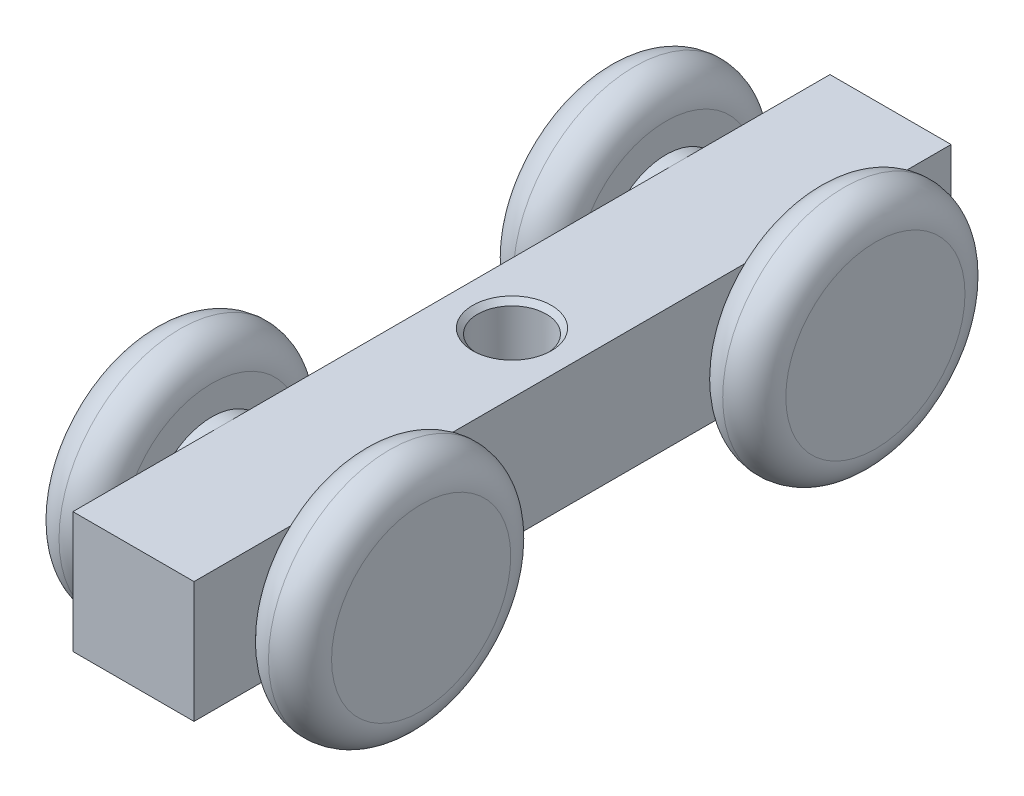
ISO-10303-21;
HEADER;
FILE_DESCRIPTION(('STEP AP214'),'2;1');
FILE_NAME('part.step','',(''),(''),'','','');
FILE_SCHEMA(('AUTOMOTIVE_DESIGN { 1 0 10303 214 1 1 1 1 }'));
ENDSEC;
DATA;
#1=APPLICATION_CONTEXT('core data for automotive mechanical design processes');
#2=APPLICATION_PROTOCOL_DEFINITION('international standard','automotive_design',2000,#1);
#3=PRODUCT_CONTEXT('',#1,'mechanical');
#4=PRODUCT('Part','Part','',(#3));
#5=PRODUCT_RELATED_PRODUCT_CATEGORY('part','',(#4));
#6=PRODUCT_DEFINITION_FORMATION('','',#4);
#7=PRODUCT_DEFINITION_CONTEXT('part definition',#1,'design');
#8=PRODUCT_DEFINITION('design','',#6,#7);
#9=PRODUCT_DEFINITION_SHAPE('','',#8);
#10=(LENGTH_UNIT() NAMED_UNIT(*) SI_UNIT(.MILLI.,.METRE.));
#11=(NAMED_UNIT(*) PLANE_ANGLE_UNIT() SI_UNIT($,.RADIAN.));
#12=(NAMED_UNIT(*) SI_UNIT($,.STERADIAN.) SOLID_ANGLE_UNIT());
#13=UNCERTAINTY_MEASURE_WITH_UNIT(LENGTH_MEASURE(1.E-05),#10,'distance_accuracy_value','');
#14=(GEOMETRIC_REPRESENTATION_CONTEXT(3) GLOBAL_UNCERTAINTY_ASSIGNED_CONTEXT((#13)) GLOBAL_UNIT_ASSIGNED_CONTEXT((#10,
#11,#12)) REPRESENTATION_CONTEXT('',''));
#15=CARTESIAN_POINT('',(0.,0.,0.));
#16=DIRECTION('',(0.,0.,1.));
#17=DIRECTION('',(1.,0.,0.));
#18=AXIS2_PLACEMENT_3D('',#15,#16,#17);
#19=CARTESIAN_POINT('',(6.,-6.,37.5));
#20=DIRECTION('',(-1.,0.,0.));
#21=DIRECTION('',(0.,0.,1.));
#22=AXIS2_PLACEMENT_3D('',#19,#20,#21);
#23=PLANE('',#22);
#24=CARTESIAN_POINT('',(6.,0.,-22.5));
#25=DIRECTION('',(-1.,0.,0.));
#26=DIRECTION('',(0.,0.,1.));
#27=AXIS2_PLACEMENT_3D('',#24,#25,#26);
#28=CIRCLE('',#27,6.);
#29=CARTESIAN_POINT('',(6.,-6.,-22.5));
#30=VERTEX_POINT('',#29);
#31=CARTESIAN_POINT('',(6.,6.,-22.5));
#32=VERTEX_POINT('',#31);
#33=EDGE_CURVE('E118',#30,#32,#28,.F.);
#34=ORIENTED_EDGE('',*,*,#33,.F.);
#35=DIRECTION('',(0.,0.,-1.));
#36=VECTOR('',#35,1.);
#37=CARTESIAN_POINT('',(6.,-6.,37.5));
#38=LINE('',#37,#36);
#39=CARTESIAN_POINT('',(6.,-6.,-37.5));
#40=VERTEX_POINT('',#39);
#41=EDGE_CURVE('E140',#30,#40,#38,.T.);
#42=ORIENTED_EDGE('',*,*,#41,.T.);
#43=DIRECTION('',(0.,1.,0.));
#44=VECTOR('',#43,1.);
#45=CARTESIAN_POINT('',(6.,-6.,-37.5));
#46=LINE('',#45,#44);
#47=CARTESIAN_POINT('',(6.,6.,-37.5));
#48=VERTEX_POINT('',#47);
#49=EDGE_CURVE('E141',#40,#48,#46,.T.);
#50=ORIENTED_EDGE('',*,*,#49,.T.);
#51=DIRECTION('',(0.,0.,-1.));
#52=VECTOR('',#51,1.);
#53=CARTESIAN_POINT('',(6.,6.,37.5));
#54=LINE('',#53,#52);
#55=EDGE_CURVE('E155',#32,#48,#54,.T.);
#56=ORIENTED_EDGE('',*,*,#55,.F.);
#57=EDGE_LOOP('',(#34,#42,#50,#56));
#58=FACE_BOUND('',#57,.T.);
#59=ADVANCED_FACE('F16',(#58),#23,.F.);
#60=EDGE_CURVE('E33',#32,#30,#28,.F.);
#61=ORIENTED_EDGE('',*,*,#60,.F.);
#62=CARTESIAN_POINT('',(6.,6.,22.5));
#63=VERTEX_POINT('',#62);
#64=EDGE_CURVE('E160',#63,#32,#54,.T.);
#65=ORIENTED_EDGE('',*,*,#64,.F.);
#66=CARTESIAN_POINT('',(6.,0.,22.5));
#67=DIRECTION('',(-1.,0.,0.));
#68=DIRECTION('',(0.,0.,1.));
#69=AXIS2_PLACEMENT_3D('',#66,#67,#68);
#70=CIRCLE('',#69,6.);
#71=CARTESIAN_POINT('',(6.,-6.,22.5));
#72=VERTEX_POINT('',#71);
#73=EDGE_CURVE('E129',#72,#63,#70,.F.);
#74=ORIENTED_EDGE('',*,*,#73,.F.);
#75=EDGE_CURVE('E149',#72,#30,#38,.T.);
#76=ORIENTED_EDGE('',*,*,#75,.T.);
#77=EDGE_LOOP('',(#61,#65,#74,#76));
#78=FACE_BOUND('',#77,.T.);
#79=ADVANCED_FACE('F224',(#78),#23,.F.);
#80=CARTESIAN_POINT('',(-6.,-6.,37.5));
#81=DIRECTION('',(1.,0.,0.));
#82=DIRECTION('',(0.,0.,-1.));
#83=AXIS2_PLACEMENT_3D('',#80,#81,#82);
#84=PLANE('',#83);
#85=CARTESIAN_POINT('',(-6.,0.,-22.5));
#86=DIRECTION('',(1.,0.,0.));
#87=DIRECTION('',(0.,0.,-1.));
#88=AXIS2_PLACEMENT_3D('',#85,#86,#87);
#89=CIRCLE('',#88,6.);
#90=CARTESIAN_POINT('',(-6.,-6.,-22.5));
#91=VERTEX_POINT('',#90);
#92=CARTESIAN_POINT('',(-6.,6.,-22.5));
#93=VERTEX_POINT('',#92);
#94=EDGE_CURVE('E104',#91,#93,#89,.F.);
#95=ORIENTED_EDGE('',*,*,#94,.F.);
#96=DIRECTION('',(0.,0.,-1.));
#97=VECTOR('',#96,1.);
#98=CARTESIAN_POINT('',(-6.,-6.,37.5));
#99=LINE('',#98,#97);
#100=CARTESIAN_POINT('',(-6.,-6.,22.5));
#101=VERTEX_POINT('',#100);
#102=EDGE_CURVE('E84',#101,#91,#99,.T.);
#103=ORIENTED_EDGE('',*,*,#102,.F.);
#104=CARTESIAN_POINT('',(-6.,0.,22.5));
#105=DIRECTION('',(1.,0.,0.));
#106=DIRECTION('',(0.,0.,-1.));
#107=AXIS2_PLACEMENT_3D('',#104,#105,#106);
#108=CIRCLE('',#107,6.);
#109=CARTESIAN_POINT('',(-6.,6.,22.5));
#110=VERTEX_POINT('',#109);
#111=EDGE_CURVE('E122',#110,#101,#108,.F.);
#112=ORIENTED_EDGE('',*,*,#111,.F.);
#113=DIRECTION('',(0.,0.,-1.));
#114=VECTOR('',#113,1.);
#115=CARTESIAN_POINT('',(-6.,6.,37.5));
#116=LINE('',#115,#114);
#117=EDGE_CURVE('E107',#110,#93,#116,.T.);
#118=ORIENTED_EDGE('',*,*,#117,.T.);
#119=EDGE_LOOP('',(#95,#103,#112,#118));
#120=FACE_BOUND('',#119,.T.);
#121=ADVANCED_FACE('F105',(#120),#84,.F.);
#122=EDGE_CURVE('E41',#93,#91,#89,.F.);
#123=ORIENTED_EDGE('',*,*,#122,.F.);
#124=CARTESIAN_POINT('',(-6.,6.,-37.5));
#125=VERTEX_POINT('',#124);
#126=EDGE_CURVE('E151',#93,#125,#116,.T.);
#127=ORIENTED_EDGE('',*,*,#126,.T.);
#128=DIRECTION('',(0.,-1.,0.));
#129=VECTOR('',#128,1.);
#130=CARTESIAN_POINT('',(-6.,-6.,-37.5));
#131=LINE('',#130,#129);
#132=CARTESIAN_POINT('',(-6.,-6.,-37.5));
#133=VERTEX_POINT('',#132);
#134=EDGE_CURVE('E99',#125,#133,#131,.T.);
#135=ORIENTED_EDGE('',*,*,#134,.T.);
#136=EDGE_CURVE('E88',#91,#133,#99,.T.);
#137=ORIENTED_EDGE('',*,*,#136,.F.);
#138=EDGE_LOOP('',(#123,#127,#135,#137));
#139=FACE_BOUND('',#138,.T.);
#140=ADVANCED_FACE('F97',(#139),#84,.F.);
#141=EDGE_CURVE('E126',#63,#72,#70,.F.);
#142=ORIENTED_EDGE('',*,*,#141,.F.);
#143=CARTESIAN_POINT('',(6.,6.,37.5));
#144=VERTEX_POINT('',#143);
#145=EDGE_CURVE('E156',#144,#63,#54,.T.);
#146=ORIENTED_EDGE('',*,*,#145,.F.);
#147=DIRECTION('',(0.,1.,0.));
#148=VECTOR('',#147,1.);
#149=CARTESIAN_POINT('',(6.,-6.,37.5));
#150=LINE('',#149,#148);
#151=CARTESIAN_POINT('',(6.,-6.,37.5));
#152=VERTEX_POINT('',#151);
#153=EDGE_CURVE('E130',#152,#144,#150,.T.);
#154=ORIENTED_EDGE('',*,*,#153,.F.);
#155=EDGE_CURVE('E101',#152,#72,#38,.T.);
#156=ORIENTED_EDGE('',*,*,#155,.T.);
#157=EDGE_LOOP('',(#142,#146,#154,#156));
#158=FACE_BOUND('',#157,.T.);
#159=ADVANCED_FACE('F227',(#158),#23,.F.);
#160=EDGE_CURVE('E125',#101,#110,#108,.F.);
#161=ORIENTED_EDGE('',*,*,#160,.F.);
#162=CARTESIAN_POINT('',(-6.,-6.,37.5));
#163=VERTEX_POINT('',#162);
#164=EDGE_CURVE('E92',#163,#101,#99,.T.);
#165=ORIENTED_EDGE('',*,*,#164,.F.);
#166=DIRECTION('',(0.,-1.,0.));
#167=VECTOR('',#166,1.);
#168=CARTESIAN_POINT('',(-6.,-6.,37.5));
#169=LINE('',#168,#167);
#170=CARTESIAN_POINT('',(-6.,6.,37.5));
#171=VERTEX_POINT('',#170);
#172=EDGE_CURVE('E136',#171,#163,#169,.T.);
#173=ORIENTED_EDGE('',*,*,#172,.F.);
#174=EDGE_CURVE('E152',#171,#110,#116,.T.);
#175=ORIENTED_EDGE('',*,*,#174,.T.);
#176=EDGE_LOOP('',(#161,#165,#173,#175));
#177=FACE_BOUND('',#176,.T.);
#178=ADVANCED_FACE('F236',(#177),#84,.F.);
#179=CARTESIAN_POINT('',(-6.,6.,37.5));
#180=DIRECTION('',(0.,-1.,0.));
#181=DIRECTION('',(0.,0.,-1.));
#182=AXIS2_PLACEMENT_3D('',#179,#180,#181);
#183=PLANE('',#182);
#184=ORIENTED_EDGE('',*,*,#126,.F.);
#185=ORIENTED_EDGE('',*,*,#117,.F.);
#186=ORIENTED_EDGE('',*,*,#174,.F.);
#187=DIRECTION('',(-1.,0.,0.));
#188=VECTOR('',#187,1.);
#189=CARTESIAN_POINT('',(-6.,6.,37.5));
#190=LINE('',#189,#188);
#191=EDGE_CURVE('E133',#144,#171,#190,.T.);
#192=ORIENTED_EDGE('',*,*,#191,.F.);
#193=ORIENTED_EDGE('',*,*,#145,.T.);
#194=ORIENTED_EDGE('',*,*,#64,.T.);
#195=ORIENTED_EDGE('',*,*,#55,.T.);
#196=DIRECTION('',(-1.,0.,0.));
#197=VECTOR('',#196,1.);
#198=CARTESIAN_POINT('',(-6.,6.,-37.5));
#199=LINE('',#198,#197);
#200=EDGE_CURVE('E144',#48,#125,#199,.T.);
#201=ORIENTED_EDGE('',*,*,#200,.T.);
#202=EDGE_LOOP('',(#184,#185,#186,#192,#193,#194,#195,#201));
#203=FACE_BOUND('',#202,.T.);
#204=CARTESIAN_POINT('',(0.,6.,0.));
#205=DIRECTION('',(0.,-1.,0.));
#206=DIRECTION('',(0.,0.,-1.));
#207=AXIS2_PLACEMENT_3D('',#204,#205,#206);
#208=CIRCLE('',#207,3.9);
#209=CARTESIAN_POINT('',(0.,6.,-3.9));
#210=VERTEX_POINT('',#209);
#211=EDGE_CURVE('E169',#210,#210,#208,.T.);
#212=ORIENTED_EDGE('',*,*,#211,.T.);
#213=EDGE_LOOP('',(#212));
#214=FACE_BOUND('',#213,.T.);
#215=ADVANCED_FACE('F243',(#203,#214),#183,.F.);
#216=CARTESIAN_POINT('',(-6.,-6.,37.5));
#217=DIRECTION('',(0.,1.,0.));
#218=DIRECTION('',(0.,0.,1.));
#219=AXIS2_PLACEMENT_3D('',#216,#217,#218);
#220=PLANE('',#219);
#221=ORIENTED_EDGE('',*,*,#102,.T.);
#222=ORIENTED_EDGE('',*,*,#136,.T.);
#223=DIRECTION('',(1.,0.,0.));
#224=VECTOR('',#223,1.);
#225=CARTESIAN_POINT('',(-6.,-6.,-37.5));
#226=LINE('',#225,#224);
#227=EDGE_CURVE('E134',#133,#40,#226,.T.);
#228=ORIENTED_EDGE('',*,*,#227,.T.);
#229=ORIENTED_EDGE('',*,*,#41,.F.);
#230=ORIENTED_EDGE('',*,*,#75,.F.);
#231=ORIENTED_EDGE('',*,*,#155,.F.);
#232=DIRECTION('',(1.,0.,0.));
#233=VECTOR('',#232,1.);
#234=CARTESIAN_POINT('',(-6.,-6.,37.5));
#235=LINE('',#234,#233);
#236=EDGE_CURVE('E138',#163,#152,#235,.T.);
#237=ORIENTED_EDGE('',*,*,#236,.F.);
#238=ORIENTED_EDGE('',*,*,#164,.T.);
#239=EDGE_LOOP('',(#221,#222,#228,#229,#230,#231,#237,#238));
#240=FACE_BOUND('',#239,.T.);
#241=CARTESIAN_POINT('',(0.,-6.,0.));
#242=DIRECTION('',(0.,1.,0.));
#243=DIRECTION('',(0.,0.,1.));
#244=AXIS2_PLACEMENT_3D('',#241,#242,#243);
#245=CIRCLE('',#244,3.9);
#246=CARTESIAN_POINT('',(0.,-6.,3.9));
#247=VERTEX_POINT('',#246);
#248=EDGE_CURVE('E159',#247,#247,#245,.T.);
#249=ORIENTED_EDGE('',*,*,#248,.T.);
#250=EDGE_LOOP('',(#249));
#251=FACE_BOUND('',#250,.T.);
#252=ADVANCED_FACE('F85',(#240,#251),#220,.F.);
#253=CARTESIAN_POINT('',(0.,0.,37.5));
#254=DIRECTION('',(0.,0.,-1.));
#255=DIRECTION('',(-1.,0.,0.));
#256=AXIS2_PLACEMENT_3D('',#253,#254,#255);
#257=PLANE('',#256);
#258=ORIENTED_EDGE('',*,*,#153,.T.);
#259=ORIENTED_EDGE('',*,*,#191,.T.);
#260=ORIENTED_EDGE('',*,*,#172,.T.);
#261=ORIENTED_EDGE('',*,*,#236,.T.);
#262=EDGE_LOOP('',(#258,#259,#260,#261));
#263=FACE_BOUND('',#262,.T.);
#264=ADVANCED_FACE('F282',(#263),#257,.F.);
#265=CARTESIAN_POINT('',(0.,0.,-37.5));
#266=DIRECTION('',(0.,0.,-1.));
#267=DIRECTION('',(-1.,0.,0.));
#268=AXIS2_PLACEMENT_3D('',#265,#266,#267);
#269=PLANE('',#268);
#270=ORIENTED_EDGE('',*,*,#49,.F.);
#271=ORIENTED_EDGE('',*,*,#227,.F.);
#272=ORIENTED_EDGE('',*,*,#134,.F.);
#273=ORIENTED_EDGE('',*,*,#200,.F.);
#274=EDGE_LOOP('',(#270,#271,#272,#273));
#275=FACE_BOUND('',#274,.T.);
#276=ADVANCED_FACE('F280',(#275),#269,.T.);
#277=CARTESIAN_POINT('',(0.,-6.,0.));
#278=DIRECTION('',(0.,1.,0.));
#279=DIRECTION('',(0.,0.,1.));
#280=AXIS2_PLACEMENT_3D('',#277,#278,#279);
#281=CYLINDRICAL_SURFACE('',#280,3.4);
#282=CARTESIAN_POINT('',(0.,-5.5,0.));
#283=DIRECTION('',(0.,1.,0.));
#284=DIRECTION('',(0.,0.,1.));
#285=AXIS2_PLACEMENT_3D('',#282,#283,#284);
#286=CIRCLE('',#285,3.4);
#287=CARTESIAN_POINT('',(0.,-5.5,3.4));
#288=VERTEX_POINT('',#287);
#289=EDGE_CURVE('E166',#288,#288,#286,.F.);
#290=ORIENTED_EDGE('',*,*,#289,.T.);
#291=EDGE_LOOP('',(#290));
#292=FACE_BOUND('',#291,.T.);
#293=CARTESIAN_POINT('',(0.,5.5,0.));
#294=DIRECTION('',(0.,-1.,0.));
#295=DIRECTION('',(0.,0.,-1.));
#296=AXIS2_PLACEMENT_3D('',#293,#294,#295);
#297=CIRCLE('',#296,3.4);
#298=CARTESIAN_POINT('',(0.,5.5,-3.4));
#299=VERTEX_POINT('',#298);
#300=EDGE_CURVE('E163',#299,#299,#297,.F.);
#301=ORIENTED_EDGE('',*,*,#300,.T.);
#302=EDGE_LOOP('',(#301));
#303=FACE_BOUND('',#302,.T.);
#304=ADVANCED_FACE('F276',(#292,#303),#281,.F.);
#305=CARTESIAN_POINT('',(0.,-6.,0.));
#306=DIRECTION('',(0.,-1.,0.));
#307=DIRECTION('',(0.,0.,-1.));
#308=AXIS2_PLACEMENT_3D('',#305,#306,#307);
#309=CONICAL_SURFACE('',#308,3.9,0.785398163397446);
#310=ORIENTED_EDGE('',*,*,#289,.F.);
#311=EDGE_LOOP('',(#310));
#312=FACE_BOUND('',#311,.T.);
#313=ORIENTED_EDGE('',*,*,#248,.F.);
#314=EDGE_LOOP('',(#313));
#315=FACE_BOUND('',#314,.T.);
#316=ADVANCED_FACE('F279',(#312,#315),#309,.F.);
#317=CARTESIAN_POINT('',(0.,5.5,0.));
#318=DIRECTION('',(0.,1.,0.));
#319=DIRECTION('',(0.,0.,1.));
#320=AXIS2_PLACEMENT_3D('',#317,#318,#319);
#321=CONICAL_SURFACE('',#320,3.4,0.78539816339745);
#322=ORIENTED_EDGE('',*,*,#211,.F.);
#323=EDGE_LOOP('',(#322));
#324=FACE_BOUND('',#323,.T.);
#325=ORIENTED_EDGE('',*,*,#300,.F.);
#326=EDGE_LOOP('',(#325));
#327=FACE_BOUND('',#326,.T.);
#328=ADVANCED_FACE('F271',(#324,#327),#321,.F.);
#329=CARTESIAN_POINT('',(7.25,0.,22.5));
#330=DIRECTION('',(-1.,0.,0.));
#331=DIRECTION('',(0.,0.,1.));
#332=AXIS2_PLACEMENT_3D('',#329,#330,#331);
#333=CYLINDRICAL_SURFACE('',#332,6.);
#334=CARTESIAN_POINT('',(-7.25,0.,22.5));
#335=DIRECTION('',(-1.,0.,0.));
#336=DIRECTION('',(0.,0.,1.));
#337=AXIS2_PLACEMENT_3D('',#334,#335,#336);
#338=CIRCLE('',#337,6.);
#339=CARTESIAN_POINT('',(-7.25,0.,28.5));
#340=VERTEX_POINT('',#339);
#341=EDGE_CURVE('E190',#340,#340,#338,.T.);
#342=ORIENTED_EDGE('',*,*,#341,.F.);
#343=EDGE_LOOP('',(#342));
#344=FACE_BOUND('',#343,.T.);
#345=ORIENTED_EDGE('',*,*,#111,.T.);
#346=ORIENTED_EDGE('',*,*,#160,.T.);
#347=EDGE_LOOP('',(#345,#346));
#348=FACE_BOUND('',#347,.T.);
#349=ADVANCED_FACE('F260',(#344,#348),#333,.T.);
#350=CARTESIAN_POINT('',(7.25,0.,22.5));
#351=DIRECTION('',(1.,0.,0.));
#352=DIRECTION('',(0.,0.,-1.));
#353=AXIS2_PLACEMENT_3D('',#350,#351,#352);
#354=CIRCLE('',#353,6.);
#355=CARTESIAN_POINT('',(7.25,0.,16.5));
#356=VERTEX_POINT('',#355);
#357=EDGE_CURVE('E119',#356,#356,#354,.T.);
#358=ORIENTED_EDGE('',*,*,#357,.F.);
#359=EDGE_LOOP('',(#358));
#360=FACE_BOUND('',#359,.T.);
#361=ORIENTED_EDGE('',*,*,#141,.T.);
#362=ORIENTED_EDGE('',*,*,#73,.T.);
#363=EDGE_LOOP('',(#361,#362));
#364=FACE_BOUND('',#363,.T.);
#365=ADVANCED_FACE('F258',(#360,#364),#333,.T.);
#366=CARTESIAN_POINT('',(7.25,0.,-22.5));
#367=DIRECTION('',(-1.,0.,0.));
#368=DIRECTION('',(0.,0.,1.));
#369=AXIS2_PLACEMENT_3D('',#366,#367,#368);
#370=CYLINDRICAL_SURFACE('',#369,6.);
#371=CARTESIAN_POINT('',(-7.25,0.,-22.5));
#372=DIRECTION('',(-1.,0.,0.));
#373=DIRECTION('',(0.,0.,1.));
#374=AXIS2_PLACEMENT_3D('',#371,#372,#373);
#375=CIRCLE('',#374,6.);
#376=CARTESIAN_POINT('',(-7.25,0.,-16.5));
#377=VERTEX_POINT('',#376);
#378=EDGE_CURVE('E199',#377,#377,#375,.T.);
#379=ORIENTED_EDGE('',*,*,#378,.F.);
#380=EDGE_LOOP('',(#379));
#381=FACE_BOUND('',#380,.T.);
#382=ORIENTED_EDGE('',*,*,#122,.T.);
#383=ORIENTED_EDGE('',*,*,#94,.T.);
#384=EDGE_LOOP('',(#382,#383));
#385=FACE_BOUND('',#384,.T.);
#386=ADVANCED_FACE('F110',(#381,#385),#370,.T.);
#387=CARTESIAN_POINT('',(7.25,0.,-22.5));
#388=DIRECTION('',(1.,0.,0.));
#389=DIRECTION('',(0.,0.,-1.));
#390=AXIS2_PLACEMENT_3D('',#387,#388,#389);
#391=CIRCLE('',#390,6.);
#392=CARTESIAN_POINT('',(7.25,0.,-28.5));
#393=VERTEX_POINT('',#392);
#394=EDGE_CURVE('E111',#393,#393,#391,.T.);
#395=ORIENTED_EDGE('',*,*,#394,.F.);
#396=EDGE_LOOP('',(#395));
#397=FACE_BOUND('',#396,.T.);
#398=ORIENTED_EDGE('',*,*,#60,.T.);
#399=ORIENTED_EDGE('',*,*,#33,.T.);
#400=EDGE_LOOP('',(#398,#399));
#401=FACE_BOUND('',#400,.T.);
#402=ADVANCED_FACE('F268',(#397,#401),#370,.T.);
#403=CARTESIAN_POINT('',(7.25,0.,22.5));
#404=DIRECTION('',(1.,0.,0.));
#405=DIRECTION('',(0.,0.,-1.));
#406=AXIS2_PLACEMENT_3D('',#403,#404,#405);
#407=PLANE('',#406);
#408=CARTESIAN_POINT('',(7.25,0.,22.5));
#409=DIRECTION('',(1.,0.,0.));
#410=DIRECTION('',(0.,0.,-1.));
#411=AXIS2_PLACEMENT_3D('',#408,#409,#410);
#412=CIRCLE('',#411,8.875);
#413=CARTESIAN_POINT('',(7.25,0.,13.625));
#414=VERTEX_POINT('',#413);
#415=EDGE_CURVE('E181',#414,#414,#412,.F.);
#416=ORIENTED_EDGE('',*,*,#415,.T.);
#417=EDGE_LOOP('',(#416));
#418=FACE_BOUND('',#417,.T.);
#419=ORIENTED_EDGE('',*,*,#357,.T.);
#420=EDGE_LOOP('',(#419));
#421=FACE_BOUND('',#420,.T.);
#422=ADVANCED_FACE('F360',(#418,#421),#407,.F.);
#423=CARTESIAN_POINT('',(13.5,0.,22.5));
#424=DIRECTION('',(1.,0.,0.));
#425=DIRECTION('',(0.,0.,-1.));
#426=AXIS2_PLACEMENT_3D('',#423,#424,#425);
#427=PLANE('',#426);
#428=CARTESIAN_POINT('',(13.5,0.,22.5));
#429=DIRECTION('',(1.,0.,0.));
#430=DIRECTION('',(0.,0.,-1.));
#431=AXIS2_PLACEMENT_3D('',#428,#429,#430);
#432=CIRCLE('',#431,8.875);
#433=CARTESIAN_POINT('',(13.5,0.,13.625));
#434=VERTEX_POINT('',#433);
#435=EDGE_CURVE('E178',#434,#434,#432,.T.);
#436=ORIENTED_EDGE('',*,*,#435,.T.);
#437=EDGE_LOOP('',(#436));
#438=FACE_BOUND('',#437,.T.);
#439=ADVANCED_FACE('F370',(#438),#427,.T.);
#440=CARTESIAN_POINT('',(7.25,0.,-22.5));
#441=DIRECTION('',(1.,0.,0.));
#442=DIRECTION('',(0.,0.,-1.));
#443=AXIS2_PLACEMENT_3D('',#440,#441,#442);
#444=PLANE('',#443);
#445=CARTESIAN_POINT('',(7.25,0.,-22.5));
#446=DIRECTION('',(1.,0.,0.));
#447=DIRECTION('',(0.,0.,-1.));
#448=AXIS2_PLACEMENT_3D('',#445,#446,#447);
#449=CIRCLE('',#448,8.875);
#450=CARTESIAN_POINT('',(7.25,0.,-31.375));
#451=VERTEX_POINT('',#450);
#452=EDGE_CURVE('E175',#451,#451,#449,.F.);
#453=ORIENTED_EDGE('',*,*,#452,.T.);
#454=EDGE_LOOP('',(#453));
#455=FACE_BOUND('',#454,.T.);
#456=ORIENTED_EDGE('',*,*,#394,.T.);
#457=EDGE_LOOP('',(#456));
#458=FACE_BOUND('',#457,.T.);
#459=ADVANCED_FACE('F380',(#455,#458),#444,.F.);
#460=CARTESIAN_POINT('',(13.5,0.,-22.5));
#461=DIRECTION('',(1.,0.,0.));
#462=DIRECTION('',(0.,0.,-1.));
#463=AXIS2_PLACEMENT_3D('',#460,#461,#462);
#464=PLANE('',#463);
#465=CARTESIAN_POINT('',(13.5,0.,-22.5));
#466=DIRECTION('',(1.,0.,0.));
#467=DIRECTION('',(0.,0.,-1.));
#468=AXIS2_PLACEMENT_3D('',#465,#466,#467);
#469=CIRCLE('',#468,8.875);
#470=CARTESIAN_POINT('',(13.5,0.,-31.375));
#471=VERTEX_POINT('',#470);
#472=EDGE_CURVE('E172',#471,#471,#469,.T.);
#473=ORIENTED_EDGE('',*,*,#472,.T.);
#474=EDGE_LOOP('',(#473));
#475=FACE_BOUND('',#474,.T.);
#476=ADVANCED_FACE('F390',(#475),#464,.T.);
#477=CARTESIAN_POINT('',(10.375,0.,-22.5));
#478=DIRECTION('',(1.,0.,0.));
#479=DIRECTION('',(0.,0.,-1.));
#480=AXIS2_PLACEMENT_3D('',#477,#478,#479);
#481=TOROIDAL_SURFACE('',#480,8.875,3.125);
#482=ORIENTED_EDGE('',*,*,#452,.F.);
#483=EDGE_LOOP('',(#482));
#484=FACE_BOUND('',#483,.T.);
#485=CARTESIAN_POINT('',(10.375,0.,-22.5));
#486=DIRECTION('',(1.,0.,0.));
#487=DIRECTION('',(0.,0.,-1.));
#488=AXIS2_PLACEMENT_3D('',#485,#486,#487);
#489=CIRCLE('',#488,12.);
#490=CARTESIAN_POINT('',(10.375,0.,-34.5));
#491=VERTEX_POINT('',#490);
#492=EDGE_CURVE('E113',#491,#491,#489,.T.);
#493=ORIENTED_EDGE('',*,*,#492,.F.);
#494=EDGE_LOOP('',(#493));
#495=FACE_BOUND('',#494,.T.);
#496=ADVANCED_FACE('F400',(#484,#495),#481,.T.);
#497=CARTESIAN_POINT('',(10.375,0.,-22.5));
#498=DIRECTION('',(1.,0.,0.));
#499=DIRECTION('',(0.,0.,-1.));
#500=AXIS2_PLACEMENT_3D('',#497,#498,#499);
#501=TOROIDAL_SURFACE('',#500,8.875,3.125);
#502=ORIENTED_EDGE('',*,*,#492,.T.);
#503=EDGE_LOOP('',(#502));
#504=FACE_BOUND('',#503,.T.);
#505=ORIENTED_EDGE('',*,*,#472,.F.);
#506=EDGE_LOOP('',(#505));
#507=FACE_BOUND('',#506,.T.);
#508=ADVANCED_FACE('F410',(#504,#507),#501,.T.);
#509=CARTESIAN_POINT('',(10.375,0.,22.5));
#510=DIRECTION('',(1.,0.,0.));
#511=DIRECTION('',(0.,0.,-1.));
#512=AXIS2_PLACEMENT_3D('',#509,#510,#511);
#513=TOROIDAL_SURFACE('',#512,8.875,3.125);
#514=ORIENTED_EDGE('',*,*,#415,.F.);
#515=EDGE_LOOP('',(#514));
#516=FACE_BOUND('',#515,.T.);
#517=CARTESIAN_POINT('',(10.375,0.,22.5));
#518=DIRECTION('',(1.,0.,0.));
#519=DIRECTION('',(0.,0.,-1.));
#520=AXIS2_PLACEMENT_3D('',#517,#518,#519);
#521=CIRCLE('',#520,12.);
#522=CARTESIAN_POINT('',(10.375,0.,10.5));
#523=VERTEX_POINT('',#522);
#524=EDGE_CURVE('E187',#523,#523,#521,.T.);
#525=ORIENTED_EDGE('',*,*,#524,.F.);
#526=EDGE_LOOP('',(#525));
#527=FACE_BOUND('',#526,.T.);
#528=ADVANCED_FACE('F420',(#516,#527),#513,.T.);
#529=CARTESIAN_POINT('',(10.375,0.,22.5));
#530=DIRECTION('',(1.,0.,0.));
#531=DIRECTION('',(0.,0.,-1.));
#532=AXIS2_PLACEMENT_3D('',#529,#530,#531);
#533=TOROIDAL_SURFACE('',#532,8.875,3.125);
#534=ORIENTED_EDGE('',*,*,#524,.T.);
#535=EDGE_LOOP('',(#534));
#536=FACE_BOUND('',#535,.T.);
#537=ORIENTED_EDGE('',*,*,#435,.F.);
#538=EDGE_LOOP('',(#537));
#539=FACE_BOUND('',#538,.T.);
#540=ADVANCED_FACE('F430',(#536,#539),#533,.T.);
#541=CARTESIAN_POINT('',(-7.25,0.,22.5));
#542=DIRECTION('',(-1.,0.,0.));
#543=DIRECTION('',(0.,0.,-1.));
#544=AXIS2_PLACEMENT_3D('',#541,#542,#543);
#545=PLANE('',#544);
#546=CARTESIAN_POINT('',(-7.25,0.,22.5));
#547=DIRECTION('',(-1.,0.,0.));
#548=DIRECTION('',(0.,0.,1.));
#549=AXIS2_PLACEMENT_3D('',#546,#547,#548);
#550=CIRCLE('',#549,8.875);
#551=CARTESIAN_POINT('',(-7.25,0.,31.375));
#552=VERTEX_POINT('',#551);
#553=EDGE_CURVE('E11',#552,#552,#550,.F.);
#554=ORIENTED_EDGE('',*,*,#553,.T.);
#555=EDGE_LOOP('',(#554));
#556=FACE_BOUND('',#555,.T.);
#557=ORIENTED_EDGE('',*,*,#341,.T.);
#558=EDGE_LOOP('',(#557));
#559=FACE_BOUND('',#558,.T.);
#560=ADVANCED_FACE('F440',(#556,#559),#545,.F.);
#561=CARTESIAN_POINT('',(-13.5,0.,22.5));
#562=DIRECTION('',(-1.,0.,0.));
#563=DIRECTION('',(0.,0.,-1.));
#564=AXIS2_PLACEMENT_3D('',#561,#562,#563);
#565=PLANE('',#564);
#566=CARTESIAN_POINT('',(-13.5,0.,22.5));
#567=DIRECTION('',(-1.,0.,0.));
#568=DIRECTION('',(0.,0.,1.));
#569=AXIS2_PLACEMENT_3D('',#566,#567,#568);
#570=CIRCLE('',#569,8.875);
#571=CARTESIAN_POINT('',(-13.5,0.,31.375));
#572=VERTEX_POINT('',#571);
#573=EDGE_CURVE('E25',#572,#572,#570,.T.);
#574=ORIENTED_EDGE('',*,*,#573,.T.);
#575=EDGE_LOOP('',(#574));
#576=FACE_BOUND('',#575,.T.);
#577=ADVANCED_FACE('F450',(#576),#565,.T.);
#578=CARTESIAN_POINT('',(-7.25,0.,-22.5));
#579=DIRECTION('',(-1.,0.,0.));
#580=DIRECTION('',(0.,0.,-1.));
#581=AXIS2_PLACEMENT_3D('',#578,#579,#580);
#582=PLANE('',#581);
#583=CARTESIAN_POINT('',(-7.25,0.,-22.5));
#584=DIRECTION('',(-1.,0.,0.));
#585=DIRECTION('',(0.,0.,1.));
#586=AXIS2_PLACEMENT_3D('',#583,#584,#585);
#587=CIRCLE('',#586,8.875);
#588=CARTESIAN_POINT('',(-7.25,0.,-13.625));
#589=VERTEX_POINT('',#588);
#590=EDGE_CURVE('E193',#589,#589,#587,.F.);
#591=ORIENTED_EDGE('',*,*,#590,.T.);
#592=EDGE_LOOP('',(#591));
#593=FACE_BOUND('',#592,.T.);
#594=ORIENTED_EDGE('',*,*,#378,.T.);
#595=EDGE_LOOP('',(#594));
#596=FACE_BOUND('',#595,.T.);
#597=ADVANCED_FACE('F460',(#593,#596),#582,.F.);
#598=CARTESIAN_POINT('',(-13.5,0.,-22.5));
#599=DIRECTION('',(-1.,0.,0.));
#600=DIRECTION('',(0.,0.,-1.));
#601=AXIS2_PLACEMENT_3D('',#598,#599,#600);
#602=PLANE('',#601);
#603=CARTESIAN_POINT('',(-13.5,0.,-22.5));
#604=DIRECTION('',(-1.,0.,0.));
#605=DIRECTION('',(0.,0.,1.));
#606=AXIS2_PLACEMENT_3D('',#603,#604,#605);
#607=CIRCLE('',#606,8.875);
#608=CARTESIAN_POINT('',(-13.5,0.,-13.625));
#609=VERTEX_POINT('',#608);
#610=EDGE_CURVE('E184',#609,#609,#607,.T.);
#611=ORIENTED_EDGE('',*,*,#610,.T.);
#612=EDGE_LOOP('',(#611));
#613=FACE_BOUND('',#612,.T.);
#614=ADVANCED_FACE('F470',(#613),#602,.T.);
#615=CARTESIAN_POINT('',(-10.375,0.,-22.5));
#616=DIRECTION('',(-1.,0.,0.));
#617=DIRECTION('',(0.,0.,1.));
#618=AXIS2_PLACEMENT_3D('',#615,#616,#617);
#619=TOROIDAL_SURFACE('',#618,8.875,3.125);
#620=ORIENTED_EDGE('',*,*,#590,.F.);
#621=EDGE_LOOP('',(#620));
#622=FACE_BOUND('',#621,.T.);
#623=CARTESIAN_POINT('',(-10.375,0.,-22.5));
#624=DIRECTION('',(-1.,0.,0.));
#625=DIRECTION('',(0.,0.,1.));
#626=AXIS2_PLACEMENT_3D('',#623,#624,#625);
#627=CIRCLE('',#626,12.);
#628=CARTESIAN_POINT('',(-10.375,0.,-10.5));
#629=VERTEX_POINT('',#628);
#630=EDGE_CURVE('E197',#629,#629,#627,.T.);
#631=ORIENTED_EDGE('',*,*,#630,.F.);
#632=EDGE_LOOP('',(#631));
#633=FACE_BOUND('',#632,.T.);
#634=ADVANCED_FACE('F219',(#622,#633),#619,.T.);
#635=CARTESIAN_POINT('',(-10.375,0.,-22.5));
#636=DIRECTION('',(-1.,0.,0.));
#637=DIRECTION('',(0.,0.,1.));
#638=AXIS2_PLACEMENT_3D('',#635,#636,#637);
#639=TOROIDAL_SURFACE('',#638,8.875,3.125);
#640=ORIENTED_EDGE('',*,*,#610,.F.);
#641=EDGE_LOOP('',(#640));
#642=FACE_BOUND('',#641,.T.);
#643=ORIENTED_EDGE('',*,*,#630,.T.);
#644=EDGE_LOOP('',(#643));
#645=FACE_BOUND('',#644,.T.);
#646=ADVANCED_FACE('F210',(#642,#645),#639,.T.);
#647=CARTESIAN_POINT('',(-10.375,0.,22.5));
#648=DIRECTION('',(-1.,0.,0.));
#649=DIRECTION('',(0.,0.,1.));
#650=AXIS2_PLACEMENT_3D('',#647,#648,#649);
#651=TOROIDAL_SURFACE('',#650,8.875,3.125);
#652=ORIENTED_EDGE('',*,*,#553,.F.);
#653=EDGE_LOOP('',(#652));
#654=FACE_BOUND('',#653,.T.);
#655=CARTESIAN_POINT('',(-10.375,0.,22.5));
#656=DIRECTION('',(-1.,0.,0.));
#657=DIRECTION('',(0.,0.,1.));
#658=AXIS2_PLACEMENT_3D('',#655,#656,#657);
#659=CIRCLE('',#658,12.);
#660=CARTESIAN_POINT('',(-10.375,0.,34.5));
#661=VERTEX_POINT('',#660);
#662=EDGE_CURVE('E20',#661,#661,#659,.T.);
#663=ORIENTED_EDGE('',*,*,#662,.F.);
#664=EDGE_LOOP('',(#663));
#665=FACE_BOUND('',#664,.T.);
#666=ADVANCED_FACE('F18',(#654,#665),#651,.T.);
#667=CARTESIAN_POINT('',(-10.375,0.,22.5));
#668=DIRECTION('',(-1.,0.,0.));
#669=DIRECTION('',(0.,0.,1.));
#670=AXIS2_PLACEMENT_3D('',#667,#668,#669);
#671=TOROIDAL_SURFACE('',#670,8.875,3.125);
#672=ORIENTED_EDGE('',*,*,#573,.F.);
#673=EDGE_LOOP('',(#672));
#674=FACE_BOUND('',#673,.T.);
#675=ORIENTED_EDGE('',*,*,#662,.T.);
#676=EDGE_LOOP('',(#675));
#677=FACE_BOUND('',#676,.T.);
#678=ADVANCED_FACE('F207',(#674,#677),#671,.T.);
#679=CLOSED_SHELL('',(#59,#79,#121,#140,#159,#178,#215,#252,#264,#276,#304,#316,#328,#349,#365,
#386,#402,#422,#439,#459,#476,#496,#508,#528,#540,#560,#577,#597,#614,#634,#646,#666,#678));
#680=MANIFOLD_SOLID_BREP('B1',#679);
#681=ADVANCED_BREP_SHAPE_REPRESENTATION('',(#18,#680),#14);
#682=SHAPE_DEFINITION_REPRESENTATION(#9,#681);
ENDSEC;
END-ISO-10303-21;
